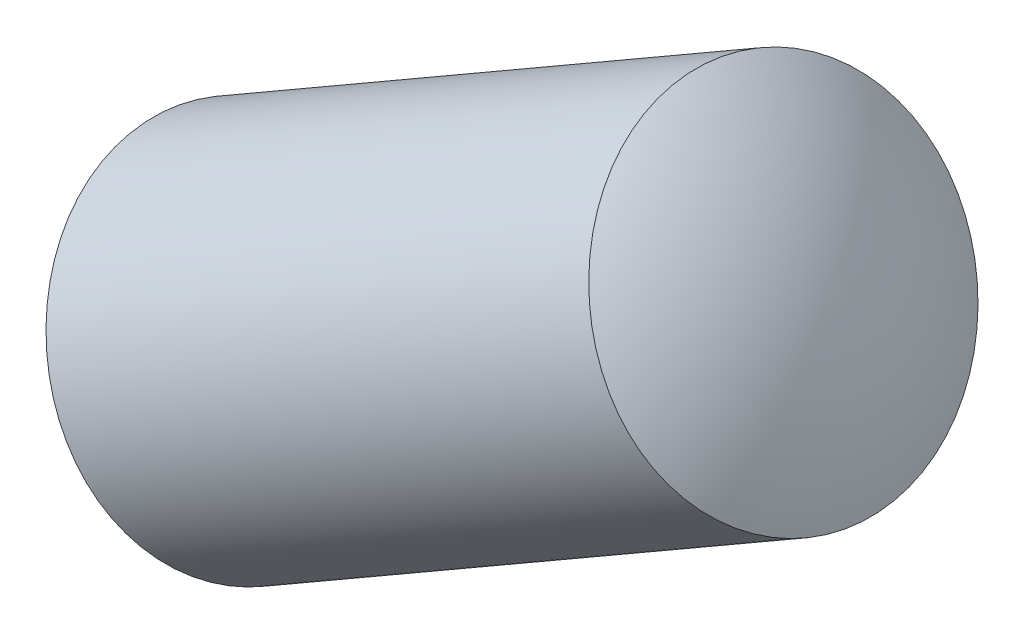
ISO-10303-21;
HEADER;
FILE_DESCRIPTION(('STEP AP214'),'2;1');
FILE_NAME('part.step','',(''),(''),'','','');
FILE_SCHEMA(('AUTOMOTIVE_DESIGN { 1 0 10303 214 1 1 1 1 }'));
ENDSEC;
DATA;
#1=APPLICATION_CONTEXT('core data for automotive mechanical design processes');
#2=APPLICATION_PROTOCOL_DEFINITION('international standard','automotive_design',2000,#1);
#3=PRODUCT_CONTEXT('',#1,'mechanical');
#4=PRODUCT('Part','Part','',(#3));
#5=PRODUCT_RELATED_PRODUCT_CATEGORY('part','',(#4));
#6=PRODUCT_DEFINITION_FORMATION('','',#4);
#7=PRODUCT_DEFINITION_CONTEXT('part definition',#1,'design');
#8=PRODUCT_DEFINITION('design','',#6,#7);
#9=PRODUCT_DEFINITION_SHAPE('','',#8);
#10=(LENGTH_UNIT() NAMED_UNIT(*) SI_UNIT(.MILLI.,.METRE.));
#11=(NAMED_UNIT(*) PLANE_ANGLE_UNIT() SI_UNIT($,.RADIAN.));
#12=(NAMED_UNIT(*) SI_UNIT($,.STERADIAN.) SOLID_ANGLE_UNIT());
#13=UNCERTAINTY_MEASURE_WITH_UNIT(LENGTH_MEASURE(1.E-05),#10,'distance_accuracy_value','');
#14=(GEOMETRIC_REPRESENTATION_CONTEXT(3) GLOBAL_UNCERTAINTY_ASSIGNED_CONTEXT((#13)) GLOBAL_UNIT_ASSIGNED_CONTEXT((#10,
#11,#12)) REPRESENTATION_CONTEXT('',''));
#15=CARTESIAN_POINT('',(0.,0.,0.));
#16=DIRECTION('',(0.,0.,1.));
#17=DIRECTION('',(1.,0.,0.));
#18=AXIS2_PLACEMENT_3D('',#15,#16,#17);
#19=CARTESIAN_POINT('',(-23.90396719429,-13.8009618943233,0.9));
#20=DIRECTION('',(-0.5,0.866025403784439,0.));
#21=DIRECTION('',(-0.866025403784439,-0.5,0.));
#22=AXIS2_PLACEMENT_3D('',#19,#20,#21);
#23=SPHERICAL_SURFACE('',#22,3.);
#24=CARTESIAN_POINT('',(-23.90396719429,-13.8009618943233,0.9));
#25=DIRECTION('',(0.866025403784439,0.5,0.));
#26=DIRECTION('',(0.,0.,-1.));
#27=AXIS2_PLACEMENT_3D('',#24,#25,#26);
#28=SPHERICAL_SURFACE('',#27,3.);
#29=CARTESIAN_POINT('',(-26.15396719429,-15.1,0.9));
#30=DIRECTION('',(0.866025403784439,0.5,0.));
#31=DIRECTION('',(0.,0.,-1.));
#32=AXIS2_PLACEMENT_3D('',#29,#30,#31);
#33=CIRCLE('',#32,1.5);
#34=CARTESIAN_POINT('',(-26.15396719429,-15.1,-0.6));
#35=VERTEX_POINT('',#34);
#36=EDGE_CURVE('E11',#35,#35,#33,.T.);
#37=ORIENTED_EDGE('',*,*,#36,.F.);
#38=EDGE_LOOP('',(#37));
#39=FACE_BOUND('',#38,.T.);
#40=ADVANCED_FACE('F17',(#39),#28,.T.);
#41=CARTESIAN_POINT('',(-23.7274300138541,-13.6990381056767,0.9));
#42=DIRECTION('',(-0.5,0.866025403784439,0.));
#43=DIRECTION('',(0.866025403784439,0.5,0.));
#44=AXIS2_PLACEMENT_3D('',#41,#42,#43);
#45=SPHERICAL_SURFACE('',#44,3.);
#46=CARTESIAN_POINT('',(-23.7274300138541,-13.6990381056767,0.9));
#47=DIRECTION('',(0.866025403784439,0.5,0.));
#48=DIRECTION('',(0.,0.,-1.));
#49=AXIS2_PLACEMENT_3D('',#46,#47,#48);
#50=SPHERICAL_SURFACE('',#49,3.);
#51=CARTESIAN_POINT('',(-21.4774300138541,-12.4,0.9));
#52=DIRECTION('',(0.866025403784439,0.5,0.));
#53=DIRECTION('',(0.,0.,-1.));
#54=AXIS2_PLACEMENT_3D('',#51,#52,#53);
#55=CIRCLE('',#54,1.5);
#56=CARTESIAN_POINT('',(-21.4774300138541,-12.4,-0.6));
#57=VERTEX_POINT('',#56);
#58=EDGE_CURVE('E20',#57,#57,#55,.T.);
#59=ORIENTED_EDGE('',*,*,#58,.T.);
#60=EDGE_LOOP('',(#59));
#61=FACE_BOUND('',#60,.T.);
#62=ADVANCED_FACE('F39',(#61),#50,.T.);
#63=CARTESIAN_POINT('',(-22.6465643089631,-13.075,0.9));
#64=DIRECTION('',(0.866025403784439,0.5,0.));
#65=DIRECTION('',(0.,0.,-1.));
#66=AXIS2_PLACEMENT_3D('',#63,#64,#65);
#67=CYLINDRICAL_SURFACE('',#66,1.5);
#68=ORIENTED_EDGE('',*,*,#36,.T.);
#69=EDGE_LOOP('',(#68));
#70=FACE_BOUND('',#69,.T.);
#71=ORIENTED_EDGE('',*,*,#58,.F.);
#72=EDGE_LOOP('',(#71));
#73=FACE_BOUND('',#72,.T.);
#74=ADVANCED_FACE('F47',(#70,#73),#67,.T.);
#75=CLOSED_SHELL('',(#40,#62,#74));
#76=MANIFOLD_SOLID_BREP('B1',#75);
#77=ADVANCED_BREP_SHAPE_REPRESENTATION('',(#18,#76),#14);
#78=SHAPE_DEFINITION_REPRESENTATION(#9,#77);
ENDSEC;
END-ISO-10303-21;
